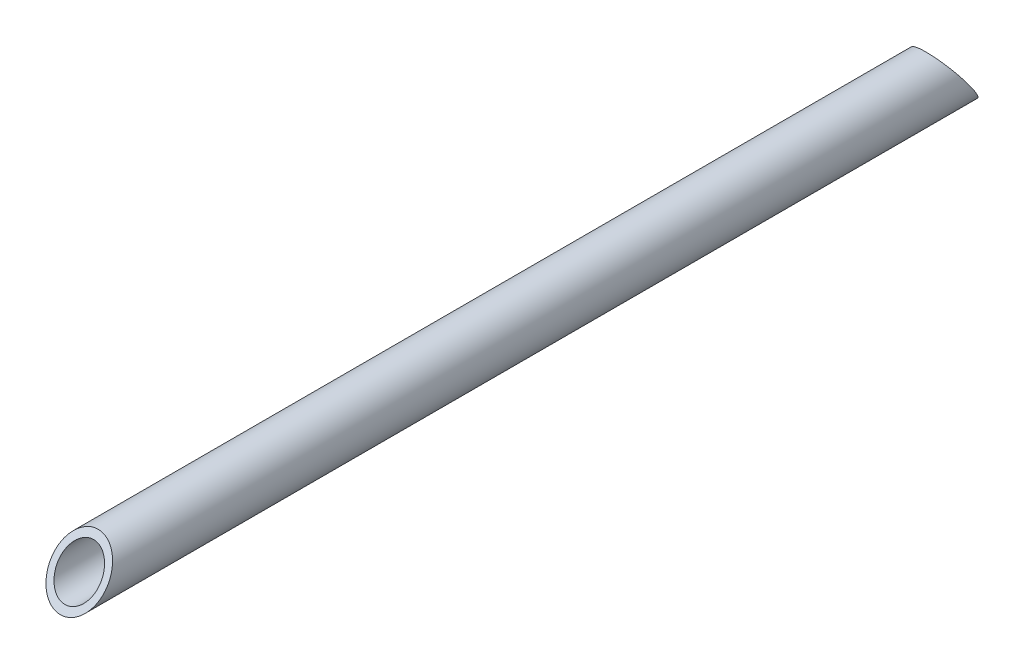
ISO-10303-21;
HEADER;
FILE_DESCRIPTION(('STEP AP214'),'2;1');
FILE_NAME('part.step','',(''),(''),'','','');
FILE_SCHEMA(('AUTOMOTIVE_DESIGN { 1 0 10303 214 1 1 1 1 }'));
ENDSEC;
DATA;
#1=APPLICATION_CONTEXT('core data for automotive mechanical design processes');
#2=APPLICATION_PROTOCOL_DEFINITION('international standard','automotive_design',2000,#1);
#3=PRODUCT_CONTEXT('',#1,'mechanical');
#4=PRODUCT('Part','Part','',(#3));
#5=PRODUCT_RELATED_PRODUCT_CATEGORY('part','',(#4));
#6=PRODUCT_DEFINITION_FORMATION('','',#4);
#7=PRODUCT_DEFINITION_CONTEXT('part definition',#1,'design');
#8=PRODUCT_DEFINITION('design','',#6,#7);
#9=PRODUCT_DEFINITION_SHAPE('','',#8);
#10=(LENGTH_UNIT() NAMED_UNIT(*) SI_UNIT(.MILLI.,.METRE.));
#11=(NAMED_UNIT(*) PLANE_ANGLE_UNIT() SI_UNIT($,.RADIAN.));
#12=(NAMED_UNIT(*) SI_UNIT($,.STERADIAN.) SOLID_ANGLE_UNIT());
#13=UNCERTAINTY_MEASURE_WITH_UNIT(LENGTH_MEASURE(1.E-05),#10,'distance_accuracy_value','');
#14=(GEOMETRIC_REPRESENTATION_CONTEXT(3) GLOBAL_UNCERTAINTY_ASSIGNED_CONTEXT((#13)) GLOBAL_UNIT_ASSIGNED_CONTEXT((#10,
#11,#12)) REPRESENTATION_CONTEXT('',''));
#15=CARTESIAN_POINT('',(0.,0.,0.));
#16=DIRECTION('',(0.,0.,1.));
#17=DIRECTION('',(1.,0.,0.));
#18=AXIS2_PLACEMENT_3D('',#15,#16,#17);
#19=CARTESIAN_POINT('',(900.,0.,-200.));
#20=DIRECTION('',(0.,0.,1.));
#21=DIRECTION('',(1.,0.,0.));
#22=AXIS2_PLACEMENT_3D('',#19,#20,#21);
#23=CYLINDRICAL_SURFACE('',#22,9.65000000000003);
#24=CARTESIAN_POINT('',(899.999999999994,3.16020998942515E-13,200.));
#25=DIRECTION('',(0.00452209739097393,-0.569208602813939,-0.8221807083104));
#26=DIRECTION('',(0.00653163689332533,-0.82215476331241,0.569226565509912));
#27=AXIS2_PLACEMENT_3D('',#24,#25,#26);
#28=ELLIPSE('',#27,11.7370790903511,9.65000000000003);
#29=CARTESIAN_POINT('',(900.0766623388,-9.6496954815063,206.681057219719));
#30=VERTEX_POINT('',#29);
#31=EDGE_CURVE('E45',#30,#30,#28,.T.);
#32=ORIENTED_EDGE('',*,*,#31,.F.);
#33=EDGE_LOOP('',(#32));
#34=FACE_BOUND('',#33,.T.);
#35=CARTESIAN_POINT('',(900.,0.,-200.));
#36=DIRECTION('',(0.00452209739098861,-0.569208602813942,0.822180708310397));
#37=DIRECTION('',(-0.00653163689339617,0.822154763312406,0.569226565509915));
#38=AXIS2_PLACEMENT_3D('',#35,#36,#37);
#39=ELLIPSE('',#38,11.7370790903511,9.65000000000003);
#40=CARTESIAN_POINT('',(899.923337661192,9.64969548150662,-193.318942780281));
#41=VERTEX_POINT('',#40);
#42=EDGE_CURVE('E58',#41,#41,#39,.T.);
#43=ORIENTED_EDGE('',*,*,#42,.F.);
#44=EDGE_LOOP('',(#43));
#45=FACE_BOUND('',#44,.T.);
#46=ADVANCED_FACE('F38',(#34,#45),#23,.F.);
#47=CARTESIAN_POINT('',(900.,0.,-200.));
#48=DIRECTION('',(0.00452209739098861,-0.569208602813942,0.822180708310397));
#49=DIRECTION('',(0.,-0.822189114975954,-0.569214422880392));
#50=AXIS2_PLACEMENT_3D('',#47,#48,#49);
#51=PLANE('',#50);
#52=ORIENTED_EDGE('',*,*,#42,.T.);
#53=EDGE_LOOP('',(#52));
#54=FACE_BOUND('',#53,.T.);
#55=CARTESIAN_POINT('',(900.,0.,-200.));
#56=DIRECTION('',(0.00452209739098861,-0.569208602813942,0.822180708310397));
#57=DIRECTION('',(-0.00653163689339617,0.822154763312406,0.569226565509915));
#58=AXIS2_PLACEMENT_3D('',#55,#56,#57);
#59=ELLIPSE('',#58,15.4467258494776,12.7);
#60=CARTESIAN_POINT('',(899.899107595559,12.6995992347289,-191.207313296329));
#61=VERTEX_POINT('',#60);
#62=EDGE_CURVE('E51',#61,#61,#59,.T.);
#63=ORIENTED_EDGE('',*,*,#62,.F.);
#64=EDGE_LOOP('',(#63));
#65=FACE_BOUND('',#64,.T.);
#66=ADVANCED_FACE('F65',(#54,#65),#51,.F.);
#67=CARTESIAN_POINT('',(900.,0.,-200.));
#68=DIRECTION('',(0.,0.,1.));
#69=DIRECTION('',(1.,0.,0.));
#70=AXIS2_PLACEMENT_3D('',#67,#68,#69);
#71=CYLINDRICAL_SURFACE('',#70,12.7);
#72=CARTESIAN_POINT('',(899.999999999994,3.16020998942515E-13,200.));
#73=DIRECTION('',(0.00452209739097393,-0.569208602813939,-0.8221807083104));
#74=DIRECTION('',(0.00653163689332533,-0.82215476331241,0.569226565509912));
#75=AXIS2_PLACEMENT_3D('',#72,#73,#74);
#76=ELLIPSE('',#75,15.4467258494775,12.7);
#77=CARTESIAN_POINT('',(900.100892404434,-12.6995992347286,208.792686703671));
#78=VERTEX_POINT('',#77);
#79=EDGE_CURVE('E10',#78,#78,#76,.T.);
#80=ORIENTED_EDGE('',*,*,#79,.T.);
#81=EDGE_LOOP('',(#80));
#82=FACE_BOUND('',#81,.T.);
#83=ORIENTED_EDGE('',*,*,#62,.T.);
#84=EDGE_LOOP('',(#83));
#85=FACE_BOUND('',#84,.T.);
#86=ADVANCED_FACE('F74',(#82,#85),#71,.T.);
#87=CARTESIAN_POINT('',(899.999999999994,3.47701307552628E-13,200.));
#88=DIRECTION('',(0.00452209739097393,-0.569208602813939,-0.8221807083104));
#89=DIRECTION('',(0.,0.822189114975957,-0.569214422880388));
#90=AXIS2_PLACEMENT_3D('',#87,#88,#89);
#91=PLANE('',#90);
#92=ORIENTED_EDGE('',*,*,#31,.T.);
#93=EDGE_LOOP('',(#92));
#94=FACE_BOUND('',#93,.T.);
#95=ORIENTED_EDGE('',*,*,#79,.F.);
#96=EDGE_LOOP('',(#95));
#97=FACE_BOUND('',#96,.T.);
#98=ADVANCED_FACE('F80',(#94,#97),#91,.F.);
#99=CLOSED_SHELL('',(#46,#66,#86,#98));
#100=MANIFOLD_SOLID_BREP('B2',#99);
#101=ADVANCED_BREP_SHAPE_REPRESENTATION('',(#18,#100),#14);
#102=SHAPE_DEFINITION_REPRESENTATION(#9,#101);
ENDSEC;
END-ISO-10303-21;
